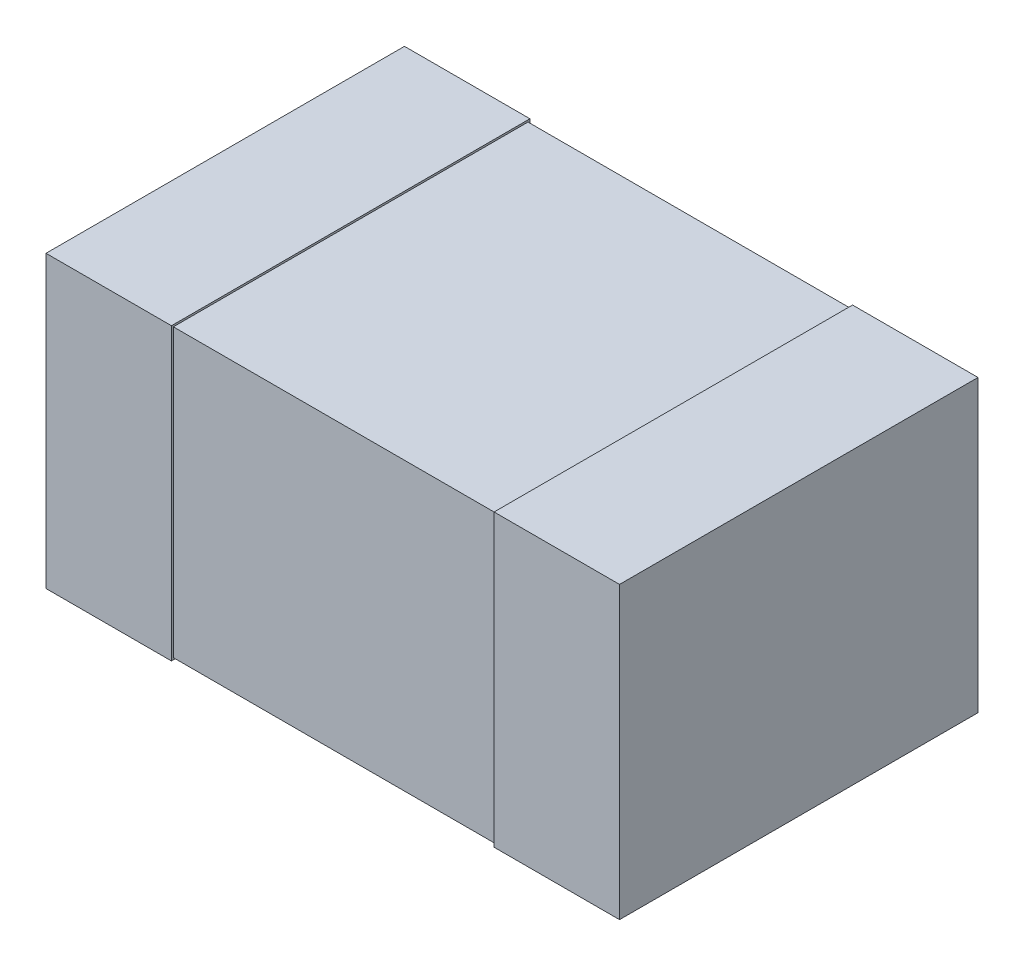
ISO-10303-21;
HEADER;
FILE_DESCRIPTION(('STEP AP214'),'2;1');
FILE_NAME('part.step','',(''),(''),'','','');
FILE_SCHEMA(('AUTOMOTIVE_DESIGN { 1 0 10303 214 1 1 1 1 }'));
ENDSEC;
DATA;
#1=APPLICATION_CONTEXT('core data for automotive mechanical design processes');
#2=APPLICATION_PROTOCOL_DEFINITION('international standard','automotive_design',2000,#1);
#3=PRODUCT_CONTEXT('',#1,'mechanical');
#4=PRODUCT('Part','Part','',(#3));
#5=PRODUCT_RELATED_PRODUCT_CATEGORY('part','',(#4));
#6=PRODUCT_DEFINITION_FORMATION('','',#4);
#7=PRODUCT_DEFINITION_CONTEXT('part definition',#1,'design');
#8=PRODUCT_DEFINITION('design','',#6,#7);
#9=PRODUCT_DEFINITION_SHAPE('','',#8);
#10=(LENGTH_UNIT() NAMED_UNIT(*) SI_UNIT(.MILLI.,.METRE.));
#11=(NAMED_UNIT(*) PLANE_ANGLE_UNIT() SI_UNIT($,.RADIAN.));
#12=(NAMED_UNIT(*) SI_UNIT($,.STERADIAN.) SOLID_ANGLE_UNIT());
#13=UNCERTAINTY_MEASURE_WITH_UNIT(LENGTH_MEASURE(1.E-05),#10,'distance_accuracy_value','');
#14=(GEOMETRIC_REPRESENTATION_CONTEXT(3) GLOBAL_UNCERTAINTY_ASSIGNED_CONTEXT((#13)) GLOBAL_UNIT_ASSIGNED_CONTEXT((#10,
#11,#12)) REPRESENTATION_CONTEXT('',''));
#15=CARTESIAN_POINT('',(0.,0.,0.));
#16=DIRECTION('',(0.,0.,1.));
#17=DIRECTION('',(1.,0.,0.));
#18=AXIS2_PLACEMENT_3D('',#15,#16,#17);
#19=CARTESIAN_POINT('',(0.8,-0.405,0.0762));
#20=DIRECTION('',(1.,0.,0.));
#21=DIRECTION('',(0.,1.,0.));
#22=AXIS2_PLACEMENT_3D('',#19,#20,#21);
#23=PLANE('',#22);
#24=DIRECTION('',(0.,1.,0.));
#25=VECTOR('',#24,1.);
#26=CARTESIAN_POINT('',(0.8,-0.405,0.0762));
#27=LINE('',#26,#25);
#28=CARTESIAN_POINT('',(0.8,-0.405,0.0762));
#29=VERTEX_POINT('',#28);
#30=CARTESIAN_POINT('',(0.8,0.405,0.0762));
#31=VERTEX_POINT('',#30);
#32=EDGE_CURVE('E188',#29,#31,#27,.T.);
#33=ORIENTED_EDGE('',*,*,#32,.T.);
#34=DIRECTION('',(0.,0.,1.));
#35=VECTOR('',#34,1.);
#36=CARTESIAN_POINT('',(0.8,0.405,0.0762));
#37=LINE('',#36,#35);
#38=CARTESIAN_POINT('',(0.8,0.405,1.0762));
#39=VERTEX_POINT('',#38);
#40=EDGE_CURVE('E122',#31,#39,#37,.T.);
#41=ORIENTED_EDGE('',*,*,#40,.T.);
#42=DIRECTION('',(0.,1.,0.));
#43=VECTOR('',#42,1.);
#44=CARTESIAN_POINT('',(0.8,-0.405,1.0762));
#45=LINE('',#44,#43);
#46=CARTESIAN_POINT('',(0.8,-0.405,1.0762));
#47=VERTEX_POINT('',#46);
#48=EDGE_CURVE('E117',#47,#39,#45,.T.);
#49=ORIENTED_EDGE('',*,*,#48,.F.);
#50=DIRECTION('',(0.,0.,1.));
#51=VECTOR('',#50,1.);
#52=CARTESIAN_POINT('',(0.8,-0.405,0.0762));
#53=LINE('',#52,#51);
#54=EDGE_CURVE('E11',#29,#47,#53,.T.);
#55=ORIENTED_EDGE('',*,*,#54,.F.);
#56=EDGE_LOOP('',(#33,#41,#49,#55));
#57=FACE_BOUND('',#56,.T.);
#58=ADVANCED_FACE('F16',(#57),#23,.T.);
#59=CARTESIAN_POINT('',(-0.8,0.405,0.0762));
#60=DIRECTION('',(-1.,0.,0.));
#61=DIRECTION('',(0.,0.,1.));
#62=AXIS2_PLACEMENT_3D('',#59,#60,#61);
#63=PLANE('',#62);
#64=DIRECTION('',(0.,-1.,0.));
#65=VECTOR('',#64,1.);
#66=CARTESIAN_POINT('',(-0.8,0.405,0.0762));
#67=LINE('',#66,#65);
#68=CARTESIAN_POINT('',(-0.8,0.405,0.0762));
#69=VERTEX_POINT('',#68);
#70=CARTESIAN_POINT('',(-0.8,-0.405,0.0762));
#71=VERTEX_POINT('',#70);
#72=EDGE_CURVE('E161',#69,#71,#67,.T.);
#73=ORIENTED_EDGE('',*,*,#72,.T.);
#74=DIRECTION('',(0.,0.,1.));
#75=VECTOR('',#74,1.);
#76=CARTESIAN_POINT('',(-0.8,-0.405,0.0762));
#77=LINE('',#76,#75);
#78=CARTESIAN_POINT('',(-0.8,-0.405,1.0762));
#79=VERTEX_POINT('',#78);
#80=EDGE_CURVE('E27',#71,#79,#77,.T.);
#81=ORIENTED_EDGE('',*,*,#80,.T.);
#82=DIRECTION('',(0.,-1.,0.));
#83=VECTOR('',#82,1.);
#84=CARTESIAN_POINT('',(-0.8,0.405,1.0762));
#85=LINE('',#84,#83);
#86=CARTESIAN_POINT('',(-0.8,0.405,1.0762));
#87=VERTEX_POINT('',#86);
#88=EDGE_CURVE('E103',#87,#79,#85,.T.);
#89=ORIENTED_EDGE('',*,*,#88,.F.);
#90=DIRECTION('',(0.,0.,1.));
#91=VECTOR('',#90,1.);
#92=CARTESIAN_POINT('',(-0.8,0.405,0.0762));
#93=LINE('',#92,#91);
#94=EDGE_CURVE('E136',#69,#87,#93,.T.);
#95=ORIENTED_EDGE('',*,*,#94,.F.);
#96=EDGE_LOOP('',(#73,#81,#89,#95));
#97=FACE_BOUND('',#96,.T.);
#98=ADVANCED_FACE('F261',(#97),#63,.T.);
#99=CARTESIAN_POINT('',(-0.8,-0.405,0.0762));
#100=DIRECTION('',(0.,-1.,0.));
#101=DIRECTION('',(0.,0.,-1.));
#102=AXIS2_PLACEMENT_3D('',#99,#100,#101);
#103=PLANE('',#102);
#104=DIRECTION('',(0.,0.,1.));
#105=VECTOR('',#104,1.);
#106=CARTESIAN_POINT('',(0.45,-0.405,0.0762));
#107=LINE('',#106,#105);
#108=CARTESIAN_POINT('',(0.45,-0.405,0.0762));
#109=VERTEX_POINT('',#108);
#110=CARTESIAN_POINT('',(0.45,-0.405,1.0762));
#111=VERTEX_POINT('',#110);
#112=EDGE_CURVE('E140',#109,#111,#107,.T.);
#113=ORIENTED_EDGE('',*,*,#112,.F.);
#114=DIRECTION('',(1.,0.,0.));
#115=VECTOR('',#114,1.);
#116=CARTESIAN_POINT('',(0.45,-0.405,0.0762));
#117=LINE('',#116,#115);
#118=EDGE_CURVE('E213',#109,#29,#117,.T.);
#119=ORIENTED_EDGE('',*,*,#118,.T.);
#120=ORIENTED_EDGE('',*,*,#54,.T.);
#121=DIRECTION('',(1.,0.,0.));
#122=VECTOR('',#121,1.);
#123=CARTESIAN_POINT('',(0.45,-0.405,1.0762));
#124=LINE('',#123,#122);
#125=EDGE_CURVE('E237',#111,#47,#124,.T.);
#126=ORIENTED_EDGE('',*,*,#125,.F.);
#127=EDGE_LOOP('',(#113,#119,#120,#126));
#128=FACE_BOUND('',#127,.T.);
#129=ADVANCED_FACE('F263',(#128),#103,.T.);
#130=CARTESIAN_POINT('',(-0.8,-0.405,0.0762));
#131=DIRECTION('',(0.,-1.,0.));
#132=DIRECTION('',(0.,0.,-1.));
#133=AXIS2_PLACEMENT_3D('',#130,#131,#132);
#134=PLANE('',#133);
#135=DIRECTION('',(0.,0.,1.));
#136=VECTOR('',#135,1.);
#137=CARTESIAN_POINT('',(-0.45,-0.405,0.0762));
#138=LINE('',#137,#136);
#139=CARTESIAN_POINT('',(-0.45,-0.405,0.0762));
#140=VERTEX_POINT('',#139);
#141=CARTESIAN_POINT('',(-0.45,-0.405,1.0762));
#142=VERTEX_POINT('',#141);
#143=EDGE_CURVE('E156',#140,#142,#138,.T.);
#144=ORIENTED_EDGE('',*,*,#143,.T.);
#145=DIRECTION('',(1.,0.,0.));
#146=VECTOR('',#145,1.);
#147=CARTESIAN_POINT('',(-0.8,-0.405,1.0762));
#148=LINE('',#147,#146);
#149=EDGE_CURVE('E233',#79,#142,#148,.T.);
#150=ORIENTED_EDGE('',*,*,#149,.F.);
#151=ORIENTED_EDGE('',*,*,#80,.F.);
#152=DIRECTION('',(1.,0.,0.));
#153=VECTOR('',#152,1.);
#154=CARTESIAN_POINT('',(-0.8,-0.405,0.0762));
#155=LINE('',#154,#153);
#156=EDGE_CURVE('E165',#71,#140,#155,.T.);
#157=ORIENTED_EDGE('',*,*,#156,.T.);
#158=EDGE_LOOP('',(#144,#150,#151,#157));
#159=FACE_BOUND('',#158,.T.);
#160=ADVANCED_FACE('F270',(#159),#134,.T.);
#161=CARTESIAN_POINT('',(0.,0.,1.0762));
#162=DIRECTION('',(0.,0.,1.));
#163=DIRECTION('',(1.,0.,0.));
#164=AXIS2_PLACEMENT_3D('',#161,#162,#163);
#165=PLANE('',#164);
#166=DIRECTION('',(0.,1.,0.));
#167=VECTOR('',#166,1.);
#168=CARTESIAN_POINT('',(0.45,-0.405,1.0762));
#169=LINE('',#168,#167);
#170=CARTESIAN_POINT('',(0.45,0.405,1.0762));
#171=VERTEX_POINT('',#170);
#172=EDGE_CURVE('E115',#111,#171,#169,.T.);
#173=ORIENTED_EDGE('',*,*,#172,.F.);
#174=ORIENTED_EDGE('',*,*,#125,.T.);
#175=ORIENTED_EDGE('',*,*,#48,.T.);
#176=DIRECTION('',(-1.,0.,0.));
#177=VECTOR('',#176,1.);
#178=CARTESIAN_POINT('',(0.8,0.405,1.0762));
#179=LINE('',#178,#177);
#180=EDGE_CURVE('E111',#39,#171,#179,.T.);
#181=ORIENTED_EDGE('',*,*,#180,.T.);
#182=EDGE_LOOP('',(#173,#174,#175,#181));
#183=FACE_BOUND('',#182,.T.);
#184=ADVANCED_FACE('F18',(#183),#165,.T.);
#185=CARTESIAN_POINT('',(0.,0.,1.0762));
#186=DIRECTION('',(0.,0.,1.));
#187=DIRECTION('',(1.,0.,0.));
#188=AXIS2_PLACEMENT_3D('',#185,#186,#187);
#189=PLANE('',#188);
#190=DIRECTION('',(0.,1.,0.));
#191=VECTOR('',#190,1.);
#192=CARTESIAN_POINT('',(-0.45,-0.405,1.0762));
#193=LINE('',#192,#191);
#194=CARTESIAN_POINT('',(-0.45,0.405,1.0762));
#195=VERTEX_POINT('',#194);
#196=EDGE_CURVE('E160',#142,#195,#193,.T.);
#197=ORIENTED_EDGE('',*,*,#196,.T.);
#198=DIRECTION('',(-1.,0.,0.));
#199=VECTOR('',#198,1.);
#200=CARTESIAN_POINT('',(-0.45,0.405,1.0762));
#201=LINE('',#200,#199);
#202=EDGE_CURVE('E123',#195,#87,#201,.T.);
#203=ORIENTED_EDGE('',*,*,#202,.T.);
#204=ORIENTED_EDGE('',*,*,#88,.T.);
#205=ORIENTED_EDGE('',*,*,#149,.T.);
#206=EDGE_LOOP('',(#197,#203,#204,#205));
#207=FACE_BOUND('',#206,.T.);
#208=ADVANCED_FACE('F254',(#207),#189,.T.);
#209=CARTESIAN_POINT('',(0.8,0.405,0.0762));
#210=DIRECTION('',(0.,1.,0.));
#211=DIRECTION('',(1.,0.,0.));
#212=AXIS2_PLACEMENT_3D('',#209,#210,#211);
#213=PLANE('',#212);
#214=DIRECTION('',(0.,0.,1.));
#215=VECTOR('',#214,1.);
#216=CARTESIAN_POINT('',(0.45,0.405,0.0762));
#217=LINE('',#216,#215);
#218=CARTESIAN_POINT('',(0.45,0.405,0.0762));
#219=VERTEX_POINT('',#218);
#220=EDGE_CURVE('E127',#219,#171,#217,.T.);
#221=ORIENTED_EDGE('',*,*,#220,.T.);
#222=ORIENTED_EDGE('',*,*,#180,.F.);
#223=ORIENTED_EDGE('',*,*,#40,.F.);
#224=DIRECTION('',(-1.,0.,0.));
#225=VECTOR('',#224,1.);
#226=CARTESIAN_POINT('',(0.8,0.405,0.0762));
#227=LINE('',#226,#225);
#228=EDGE_CURVE('E131',#31,#219,#227,.T.);
#229=ORIENTED_EDGE('',*,*,#228,.T.);
#230=EDGE_LOOP('',(#221,#222,#223,#229));
#231=FACE_BOUND('',#230,.T.);
#232=ADVANCED_FACE('F128',(#231),#213,.T.);
#233=CARTESIAN_POINT('',(0.8,0.405,0.0762));
#234=DIRECTION('',(0.,1.,0.));
#235=DIRECTION('',(1.,0.,0.));
#236=AXIS2_PLACEMENT_3D('',#233,#234,#235);
#237=PLANE('',#236);
#238=DIRECTION('',(0.,0.,1.));
#239=VECTOR('',#238,1.);
#240=CARTESIAN_POINT('',(-0.45,0.405,0.0762));
#241=LINE('',#240,#239);
#242=CARTESIAN_POINT('',(-0.45,0.405,0.0762));
#243=VERTEX_POINT('',#242);
#244=EDGE_CURVE('E205',#243,#195,#241,.T.);
#245=ORIENTED_EDGE('',*,*,#244,.F.);
#246=DIRECTION('',(-1.,0.,0.));
#247=VECTOR('',#246,1.);
#248=CARTESIAN_POINT('',(-0.45,0.405,0.0762));
#249=LINE('',#248,#247);
#250=EDGE_CURVE('E164',#243,#69,#249,.T.);
#251=ORIENTED_EDGE('',*,*,#250,.T.);
#252=ORIENTED_EDGE('',*,*,#94,.T.);
#253=ORIENTED_EDGE('',*,*,#202,.F.);
#254=EDGE_LOOP('',(#245,#251,#252,#253));
#255=FACE_BOUND('',#254,.T.);
#256=ADVANCED_FACE('F259',(#255),#237,.T.);
#257=CARTESIAN_POINT('',(0.45,-0.405,0.081534));
#258=DIRECTION('',(1.,0.,0.));
#259=DIRECTION('',(0.,1.,0.));
#260=AXIS2_PLACEMENT_3D('',#257,#258,#259);
#261=PLANE('',#260);
#262=DIRECTION('',(0.,1.,0.));
#263=VECTOR('',#262,1.);
#264=CARTESIAN_POINT('',(0.45,-0.399666,0.081534));
#265=LINE('',#264,#263);
#266=CARTESIAN_POINT('',(0.45,-0.399666,0.081534));
#267=VERTEX_POINT('',#266);
#268=CARTESIAN_POINT('',(0.45,0.399666,0.081534));
#269=VERTEX_POINT('',#268);
#270=EDGE_CURVE('E147',#267,#269,#265,.T.);
#271=ORIENTED_EDGE('',*,*,#270,.T.);
#272=DIRECTION('',(0.,0.,1.));
#273=VECTOR('',#272,1.);
#274=CARTESIAN_POINT('',(0.45,0.399666,0.081534));
#275=LINE('',#274,#273);
#276=CARTESIAN_POINT('',(0.45,0.399666,1.070866));
#277=VERTEX_POINT('',#276);
#278=EDGE_CURVE('E200',#269,#277,#275,.T.);
#279=ORIENTED_EDGE('',*,*,#278,.T.);
#280=DIRECTION('',(0.,-1.,0.));
#281=VECTOR('',#280,1.);
#282=CARTESIAN_POINT('',(0.45,0.399666,1.070866));
#283=LINE('',#282,#281);
#284=CARTESIAN_POINT('',(0.45,-0.399666,1.070866));
#285=VERTEX_POINT('',#284);
#286=EDGE_CURVE('E151',#277,#285,#283,.T.);
#287=ORIENTED_EDGE('',*,*,#286,.T.);
#288=DIRECTION('',(0.,0.,-1.));
#289=VECTOR('',#288,1.);
#290=CARTESIAN_POINT('',(0.45,-0.399666,1.070866));
#291=LINE('',#290,#289);
#292=EDGE_CURVE('E218',#285,#267,#291,.T.);
#293=ORIENTED_EDGE('',*,*,#292,.T.);
#294=EDGE_LOOP('',(#271,#279,#287,#293));
#295=FACE_BOUND('',#294,.T.);
#296=DIRECTION('',(0.,1.,0.));
#297=VECTOR('',#296,1.);
#298=CARTESIAN_POINT('',(0.45,-0.405,0.0762));
#299=LINE('',#298,#297);
#300=EDGE_CURVE('E172',#109,#219,#299,.T.);
#301=ORIENTED_EDGE('',*,*,#300,.F.);
#302=ORIENTED_EDGE('',*,*,#112,.T.);
#303=ORIENTED_EDGE('',*,*,#172,.T.);
#304=ORIENTED_EDGE('',*,*,#220,.F.);
#305=EDGE_LOOP('',(#301,#302,#303,#304));
#306=FACE_BOUND('',#305,.T.);
#307=ADVANCED_FACE('F138',(#295,#306),#261,.F.);
#308=CARTESIAN_POINT('',(-0.45,-0.405,0.081534));
#309=DIRECTION('',(0.,0.,1.));
#310=DIRECTION('',(1.,0.,0.));
#311=AXIS2_PLACEMENT_3D('',#308,#309,#310);
#312=PLANE('',#311);
#313=DIRECTION('',(1.,0.,0.));
#314=VECTOR('',#313,1.);
#315=CARTESIAN_POINT('',(-0.45,-0.399666,0.081534));
#316=LINE('',#315,#314);
#317=CARTESIAN_POINT('',(-0.45,-0.399666,0.081534));
#318=VERTEX_POINT('',#317);
#319=EDGE_CURVE('E208',#318,#267,#316,.T.);
#320=ORIENTED_EDGE('',*,*,#319,.F.);
#321=DIRECTION('',(0.,1.,0.));
#322=VECTOR('',#321,1.);
#323=CARTESIAN_POINT('',(-0.45,-0.399666,0.081534));
#324=LINE('',#323,#322);
#325=CARTESIAN_POINT('',(-0.45,0.399666,0.081534));
#326=VERTEX_POINT('',#325);
#327=EDGE_CURVE('E192',#318,#326,#324,.T.);
#328=ORIENTED_EDGE('',*,*,#327,.T.);
#329=DIRECTION('',(1.,0.,0.));
#330=VECTOR('',#329,1.);
#331=CARTESIAN_POINT('',(-0.45,0.399666,0.081534));
#332=LINE('',#331,#330);
#333=EDGE_CURVE('E214',#326,#269,#332,.T.);
#334=ORIENTED_EDGE('',*,*,#333,.T.);
#335=ORIENTED_EDGE('',*,*,#270,.F.);
#336=EDGE_LOOP('',(#320,#328,#334,#335));
#337=FACE_BOUND('',#336,.T.);
#338=ADVANCED_FACE('F286',(#337),#312,.F.);
#339=CARTESIAN_POINT('',(-0.45,0.399666,0.0762));
#340=DIRECTION('',(0.,-1.,0.));
#341=DIRECTION('',(0.,0.,-1.));
#342=AXIS2_PLACEMENT_3D('',#339,#340,#341);
#343=PLANE('',#342);
#344=ORIENTED_EDGE('',*,*,#333,.F.);
#345=DIRECTION('',(0.,0.,1.));
#346=VECTOR('',#345,1.);
#347=CARTESIAN_POINT('',(-0.45,0.399666,0.081534));
#348=LINE('',#347,#346);
#349=CARTESIAN_POINT('',(-0.45,0.399666,1.070866));
#350=VERTEX_POINT('',#349);
#351=EDGE_CURVE('E189',#326,#350,#348,.T.);
#352=ORIENTED_EDGE('',*,*,#351,.T.);
#353=DIRECTION('',(1.,0.,0.));
#354=VECTOR('',#353,1.);
#355=CARTESIAN_POINT('',(-0.45,0.399666,1.070866));
#356=LINE('',#355,#354);
#357=EDGE_CURVE('E221',#350,#277,#356,.T.);
#358=ORIENTED_EDGE('',*,*,#357,.T.);
#359=ORIENTED_EDGE('',*,*,#278,.F.);
#360=EDGE_LOOP('',(#344,#352,#358,#359));
#361=FACE_BOUND('',#360,.T.);
#362=ADVANCED_FACE('F298',(#361),#343,.F.);
#363=CARTESIAN_POINT('',(-0.45,0.405,1.070866));
#364=DIRECTION('',(0.,0.,-1.));
#365=DIRECTION('',(0.,-1.,0.));
#366=AXIS2_PLACEMENT_3D('',#363,#364,#365);
#367=PLANE('',#366);
#368=ORIENTED_EDGE('',*,*,#357,.F.);
#369=DIRECTION('',(0.,-1.,0.));
#370=VECTOR('',#369,1.);
#371=CARTESIAN_POINT('',(-0.45,0.399666,1.070866));
#372=LINE('',#371,#370);
#373=CARTESIAN_POINT('',(-0.45,-0.399666,1.070866));
#374=VERTEX_POINT('',#373);
#375=EDGE_CURVE('E20',#350,#374,#372,.T.);
#376=ORIENTED_EDGE('',*,*,#375,.T.);
#377=DIRECTION('',(1.,0.,0.));
#378=VECTOR('',#377,1.);
#379=CARTESIAN_POINT('',(-0.45,-0.399666,1.070866));
#380=LINE('',#379,#378);
#381=EDGE_CURVE('E196',#374,#285,#380,.T.);
#382=ORIENTED_EDGE('',*,*,#381,.T.);
#383=ORIENTED_EDGE('',*,*,#286,.F.);
#384=EDGE_LOOP('',(#368,#376,#382,#383));
#385=FACE_BOUND('',#384,.T.);
#386=ADVANCED_FACE('F276',(#385),#367,.F.);
#387=CARTESIAN_POINT('',(-0.45,-0.399666,1.0762));
#388=DIRECTION('',(0.,1.,0.));
#389=DIRECTION('',(1.,0.,0.));
#390=AXIS2_PLACEMENT_3D('',#387,#388,#389);
#391=PLANE('',#390);
#392=ORIENTED_EDGE('',*,*,#381,.F.);
#393=DIRECTION('',(0.,0.,-1.));
#394=VECTOR('',#393,1.);
#395=CARTESIAN_POINT('',(-0.45,-0.399666,1.070866));
#396=LINE('',#395,#394);
#397=EDGE_CURVE('E159',#374,#318,#396,.T.);
#398=ORIENTED_EDGE('',*,*,#397,.T.);
#399=ORIENTED_EDGE('',*,*,#319,.T.);
#400=ORIENTED_EDGE('',*,*,#292,.F.);
#401=EDGE_LOOP('',(#392,#398,#399,#400));
#402=FACE_BOUND('',#401,.T.);
#403=ADVANCED_FACE('F293',(#402),#391,.F.);
#404=CARTESIAN_POINT('',(-0.45,-0.405,0.0762));
#405=DIRECTION('',(-1.,0.,0.));
#406=DIRECTION('',(0.,0.,1.));
#407=AXIS2_PLACEMENT_3D('',#404,#405,#406);
#408=PLANE('',#407);
#409=ORIENTED_EDGE('',*,*,#397,.F.);
#410=ORIENTED_EDGE('',*,*,#375,.F.);
#411=ORIENTED_EDGE('',*,*,#351,.F.);
#412=ORIENTED_EDGE('',*,*,#327,.F.);
#413=EDGE_LOOP('',(#409,#410,#411,#412));
#414=FACE_BOUND('',#413,.T.);
#415=DIRECTION('',(0.,1.,0.));
#416=VECTOR('',#415,1.);
#417=CARTESIAN_POINT('',(-0.45,-0.405,0.0762));
#418=LINE('',#417,#416);
#419=EDGE_CURVE('E176',#140,#243,#418,.T.);
#420=ORIENTED_EDGE('',*,*,#419,.T.);
#421=ORIENTED_EDGE('',*,*,#244,.T.);
#422=ORIENTED_EDGE('',*,*,#196,.F.);
#423=ORIENTED_EDGE('',*,*,#143,.F.);
#424=EDGE_LOOP('',(#420,#421,#422,#423));
#425=FACE_BOUND('',#424,.T.);
#426=ADVANCED_FACE('F282',(#414,#425),#408,.F.);
#427=CARTESIAN_POINT('',(0.,0.,0.0762));
#428=DIRECTION('',(0.,0.,1.));
#429=DIRECTION('',(1.,0.,0.));
#430=AXIS2_PLACEMENT_3D('',#427,#428,#429);
#431=PLANE('',#430);
#432=ORIENTED_EDGE('',*,*,#300,.T.);
#433=ORIENTED_EDGE('',*,*,#228,.F.);
#434=ORIENTED_EDGE('',*,*,#32,.F.);
#435=ORIENTED_EDGE('',*,*,#118,.F.);
#436=EDGE_LOOP('',(#432,#433,#434,#435));
#437=FACE_BOUND('',#436,.T.);
#438=ADVANCED_FACE('F278',(#437),#431,.F.);
#439=CARTESIAN_POINT('',(0.,0.,0.0762));
#440=DIRECTION('',(0.,0.,1.));
#441=DIRECTION('',(1.,0.,0.));
#442=AXIS2_PLACEMENT_3D('',#439,#440,#441);
#443=PLANE('',#442);
#444=ORIENTED_EDGE('',*,*,#419,.F.);
#445=ORIENTED_EDGE('',*,*,#156,.F.);
#446=ORIENTED_EDGE('',*,*,#72,.F.);
#447=ORIENTED_EDGE('',*,*,#250,.F.);
#448=EDGE_LOOP('',(#444,#445,#446,#447));
#449=FACE_BOUND('',#448,.T.);
#450=ADVANCED_FACE('F281',(#449),#443,.F.);
#451=CLOSED_SHELL('',(#58,#98,#129,#160,#184,#208,#232,#256,#307,#338,#362,#386,#403,#426,#438,#450));
#452=MANIFOLD_SOLID_BREP('B1',#451);
#453=ADVANCED_BREP_SHAPE_REPRESENTATION('',(#18,#452),#14);
#454=SHAPE_DEFINITION_REPRESENTATION(#9,#453);
ENDSEC;
END-ISO-10303-21;
